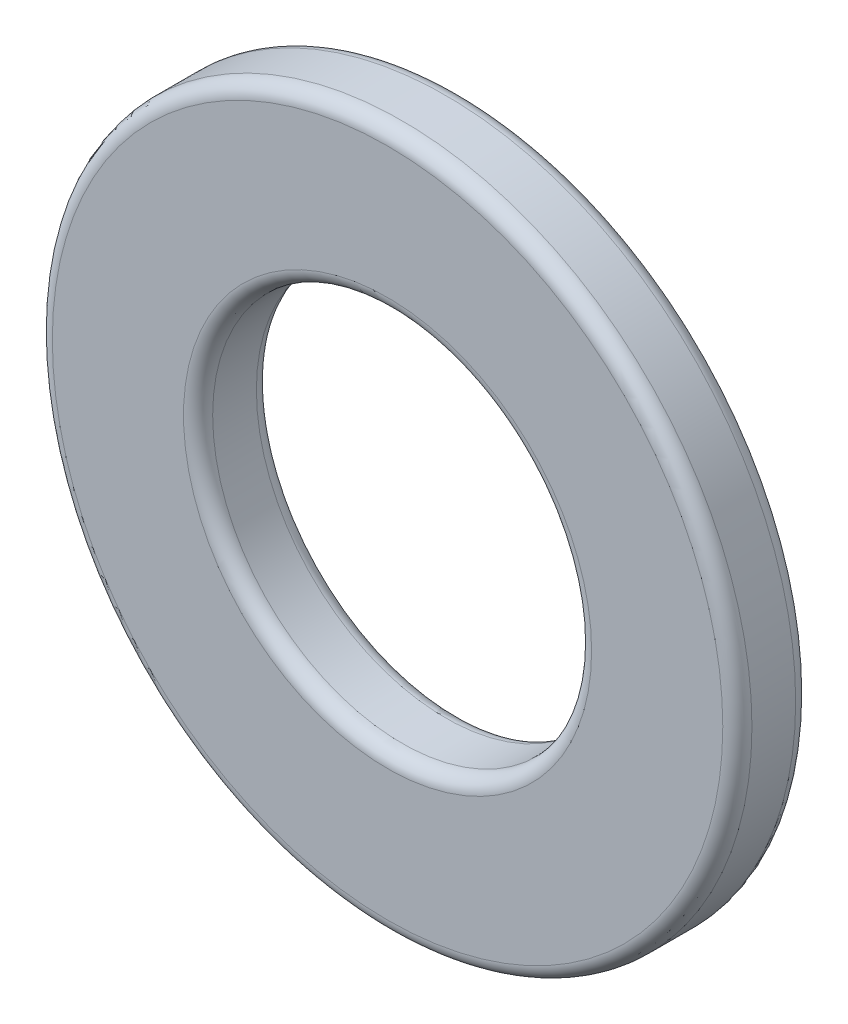
ISO-10303-21;
HEADER;
FILE_DESCRIPTION(('STEP AP214'),'2;1');
FILE_NAME('part.step','',(''),(''),'','','');
FILE_SCHEMA(('AUTOMOTIVE_DESIGN { 1 0 10303 214 1 1 1 1 }'));
ENDSEC;
DATA;
#1=APPLICATION_CONTEXT('core data for automotive mechanical design processes');
#2=APPLICATION_PROTOCOL_DEFINITION('international standard','automotive_design',2000,#1);
#3=PRODUCT_CONTEXT('',#1,'mechanical');
#4=PRODUCT('Part','Part','',(#3));
#5=PRODUCT_RELATED_PRODUCT_CATEGORY('part','',(#4));
#6=PRODUCT_DEFINITION_FORMATION('','',#4);
#7=PRODUCT_DEFINITION_CONTEXT('part definition',#1,'design');
#8=PRODUCT_DEFINITION('design','',#6,#7);
#9=PRODUCT_DEFINITION_SHAPE('','',#8);
#10=(LENGTH_UNIT() NAMED_UNIT(*) SI_UNIT(.MILLI.,.METRE.));
#11=(NAMED_UNIT(*) PLANE_ANGLE_UNIT() SI_UNIT($,.RADIAN.));
#12=(NAMED_UNIT(*) SI_UNIT($,.STERADIAN.) SOLID_ANGLE_UNIT());
#13=UNCERTAINTY_MEASURE_WITH_UNIT(LENGTH_MEASURE(1.E-05),#10,'distance_accuracy_value','');
#14=(GEOMETRIC_REPRESENTATION_CONTEXT(3) GLOBAL_UNCERTAINTY_ASSIGNED_CONTEXT((#13)) GLOBAL_UNIT_ASSIGNED_CONTEXT((#10,
#11,#12)) REPRESENTATION_CONTEXT('',''));
#15=CARTESIAN_POINT('',(0.,0.,0.));
#16=DIRECTION('',(0.,0.,1.));
#17=DIRECTION('',(1.,0.,0.));
#18=AXIS2_PLACEMENT_3D('',#15,#16,#17);
#19=CARTESIAN_POINT('',(0.,0.,2.5));
#20=DIRECTION('',(0.,0.,1.));
#21=DIRECTION('',(1.,0.,0.));
#22=AXIS2_PLACEMENT_3D('',#19,#20,#21);
#23=PLANE('',#22);
#24=CARTESIAN_POINT('',(0.,0.,2.5));
#25=DIRECTION('',(0.,0.,1.));
#26=DIRECTION('',(1.,0.,0.));
#27=AXIS2_PLACEMENT_3D('',#24,#25,#26);
#28=CIRCLE('',#27,11.5);
#29=CARTESIAN_POINT('',(11.5,0.,2.5));
#30=VERTEX_POINT('',#29);
#31=EDGE_CURVE('E10',#30,#30,#28,.T.);
#32=ORIENTED_EDGE('',*,*,#31,.T.);
#33=EDGE_LOOP('',(#32));
#34=FACE_BOUND('',#33,.T.);
#35=CARTESIAN_POINT('',(0.,0.,2.5));
#36=DIRECTION('',(0.,0.,1.));
#37=DIRECTION('',(1.,0.,0.));
#38=AXIS2_PLACEMENT_3D('',#35,#36,#37);
#39=CIRCLE('',#38,7.);
#40=CARTESIAN_POINT('',(7.,0.,2.5));
#41=VERTEX_POINT('',#40);
#42=EDGE_CURVE('E37',#41,#41,#39,.F.);
#43=ORIENTED_EDGE('',*,*,#42,.T.);
#44=EDGE_LOOP('',(#43));
#45=FACE_BOUND('',#44,.T.);
#46=ADVANCED_FACE('F30',(#34,#45),#23,.T.);
#47=CARTESIAN_POINT('',(0.,0.,0.));
#48=DIRECTION('',(0.,0.,1.));
#49=DIRECTION('',(1.,0.,0.));
#50=AXIS2_PLACEMENT_3D('',#47,#48,#49);
#51=PLANE('',#50);
#52=CARTESIAN_POINT('',(0.,0.,0.));
#53=DIRECTION('',(0.,0.,1.));
#54=DIRECTION('',(1.,0.,0.));
#55=AXIS2_PLACEMENT_3D('',#52,#53,#54);
#56=CIRCLE('',#55,7.);
#57=CARTESIAN_POINT('',(7.,0.,0.));
#58=VERTEX_POINT('',#57);
#59=EDGE_CURVE('E56',#58,#58,#56,.T.);
#60=ORIENTED_EDGE('',*,*,#59,.T.);
#61=EDGE_LOOP('',(#60));
#62=FACE_BOUND('',#61,.T.);
#63=CARTESIAN_POINT('',(0.,0.,0.));
#64=DIRECTION('',(0.,0.,1.));
#65=DIRECTION('',(1.,0.,0.));
#66=AXIS2_PLACEMENT_3D('',#63,#64,#65);
#67=CIRCLE('',#66,11.5);
#68=CARTESIAN_POINT('',(11.5,0.,0.));
#69=VERTEX_POINT('',#68);
#70=EDGE_CURVE('E59',#69,#69,#67,.F.);
#71=ORIENTED_EDGE('',*,*,#70,.T.);
#72=EDGE_LOOP('',(#71));
#73=FACE_BOUND('',#72,.T.);
#74=ADVANCED_FACE('F63',(#62,#73),#51,.F.);
#75=CARTESIAN_POINT('',(0.,0.,2.5));
#76=DIRECTION('',(0.,0.,-1.));
#77=DIRECTION('',(-1.,0.,0.));
#78=AXIS2_PLACEMENT_3D('',#75,#76,#77);
#79=CYLINDRICAL_SURFACE('',#78,12.);
#80=CARTESIAN_POINT('',(0.,0.,0.5));
#81=DIRECTION('',(0.,0.,1.));
#82=DIRECTION('',(1.,0.,0.));
#83=AXIS2_PLACEMENT_3D('',#80,#81,#82);
#84=CIRCLE('',#83,12.);
#85=CARTESIAN_POINT('',(12.,0.,0.5));
#86=VERTEX_POINT('',#85);
#87=EDGE_CURVE('E41',#86,#86,#84,.T.);
#88=ORIENTED_EDGE('',*,*,#87,.T.);
#89=EDGE_LOOP('',(#88));
#90=FACE_BOUND('',#89,.T.);
#91=CARTESIAN_POINT('',(0.,0.,2.));
#92=DIRECTION('',(0.,0.,1.));
#93=DIRECTION('',(1.,0.,0.));
#94=AXIS2_PLACEMENT_3D('',#91,#92,#93);
#95=CIRCLE('',#94,12.);
#96=CARTESIAN_POINT('',(12.,0.,2.));
#97=VERTEX_POINT('',#96);
#98=EDGE_CURVE('E45',#97,#97,#95,.F.);
#99=ORIENTED_EDGE('',*,*,#98,.T.);
#100=EDGE_LOOP('',(#99));
#101=FACE_BOUND('',#100,.T.);
#102=ADVANCED_FACE('F73',(#90,#101),#79,.T.);
#103=CARTESIAN_POINT('',(0.,0.,2.5));
#104=DIRECTION('',(0.,0.,-1.));
#105=DIRECTION('',(-1.,0.,0.));
#106=AXIS2_PLACEMENT_3D('',#103,#104,#105);
#107=CYLINDRICAL_SURFACE('',#106,6.5);
#108=CARTESIAN_POINT('',(0.,0.,0.5));
#109=DIRECTION('',(0.,0.,1.));
#110=DIRECTION('',(1.,0.,0.));
#111=AXIS2_PLACEMENT_3D('',#108,#109,#110);
#112=CIRCLE('',#111,6.5);
#113=CARTESIAN_POINT('',(6.5,0.,0.5));
#114=VERTEX_POINT('',#113);
#115=EDGE_CURVE('E50',#114,#114,#112,.F.);
#116=ORIENTED_EDGE('',*,*,#115,.T.);
#117=EDGE_LOOP('',(#116));
#118=FACE_BOUND('',#117,.T.);
#119=CARTESIAN_POINT('',(0.,0.,2.));
#120=DIRECTION('',(0.,0.,1.));
#121=DIRECTION('',(1.,0.,0.));
#122=AXIS2_PLACEMENT_3D('',#119,#120,#121);
#123=CIRCLE('',#122,6.5);
#124=CARTESIAN_POINT('',(6.5,0.,2.));
#125=VERTEX_POINT('',#124);
#126=EDGE_CURVE('E53',#125,#125,#123,.T.);
#127=ORIENTED_EDGE('',*,*,#126,.T.);
#128=EDGE_LOOP('',(#127));
#129=FACE_BOUND('',#128,.T.);
#130=ADVANCED_FACE('F76',(#118,#129),#107,.F.);
#131=CARTESIAN_POINT('',(0.,0.,0.5));
#132=DIRECTION('',(0.,0.,1.));
#133=DIRECTION('',(1.,0.,0.));
#134=AXIS2_PLACEMENT_3D('',#131,#132,#133);
#135=TOROIDAL_SURFACE('',#134,7.,0.5);
#136=ORIENTED_EDGE('',*,*,#115,.F.);
#137=EDGE_LOOP('',(#136));
#138=FACE_BOUND('',#137,.T.);
#139=ORIENTED_EDGE('',*,*,#59,.F.);
#140=EDGE_LOOP('',(#139));
#141=FACE_BOUND('',#140,.T.);
#142=ADVANCED_FACE('F69',(#138,#141),#135,.T.);
#143=CARTESIAN_POINT('',(0.,0.,0.5));
#144=DIRECTION('',(0.,0.,1.));
#145=DIRECTION('',(1.,0.,0.));
#146=AXIS2_PLACEMENT_3D('',#143,#144,#145);
#147=TOROIDAL_SURFACE('',#146,11.5,0.5);
#148=ORIENTED_EDGE('',*,*,#70,.F.);
#149=EDGE_LOOP('',(#148));
#150=FACE_BOUND('',#149,.T.);
#151=ORIENTED_EDGE('',*,*,#87,.F.);
#152=EDGE_LOOP('',(#151));
#153=FACE_BOUND('',#152,.T.);
#154=ADVANCED_FACE('F65',(#150,#153),#147,.T.);
#155=CARTESIAN_POINT('',(0.,0.,2.));
#156=DIRECTION('',(0.,0.,1.));
#157=DIRECTION('',(1.,0.,0.));
#158=AXIS2_PLACEMENT_3D('',#155,#156,#157);
#159=TOROIDAL_SURFACE('',#158,11.5,0.5);
#160=ORIENTED_EDGE('',*,*,#98,.F.);
#161=EDGE_LOOP('',(#160));
#162=FACE_BOUND('',#161,.T.);
#163=ORIENTED_EDGE('',*,*,#31,.F.);
#164=EDGE_LOOP('',(#163));
#165=FACE_BOUND('',#164,.T.);
#166=ADVANCED_FACE('F68',(#162,#165),#159,.T.);
#167=CARTESIAN_POINT('',(0.,0.,2.));
#168=DIRECTION('',(0.,0.,1.));
#169=DIRECTION('',(1.,0.,0.));
#170=AXIS2_PLACEMENT_3D('',#167,#168,#169);
#171=TOROIDAL_SURFACE('',#170,7.,0.5);
#172=ORIENTED_EDGE('',*,*,#42,.F.);
#173=EDGE_LOOP('',(#172));
#174=FACE_BOUND('',#173,.T.);
#175=ORIENTED_EDGE('',*,*,#126,.F.);
#176=EDGE_LOOP('',(#175));
#177=FACE_BOUND('',#176,.T.);
#178=ADVANCED_FACE('F32',(#174,#177),#171,.T.);
#179=CLOSED_SHELL('',(#46,#74,#102,#130,#142,#154,#166,#178));
#180=MANIFOLD_SOLID_BREP('B2',#179);
#181=ADVANCED_BREP_SHAPE_REPRESENTATION('',(#18,#180),#14);
#182=SHAPE_DEFINITION_REPRESENTATION(#9,#181);
ENDSEC;
END-ISO-10303-21;
